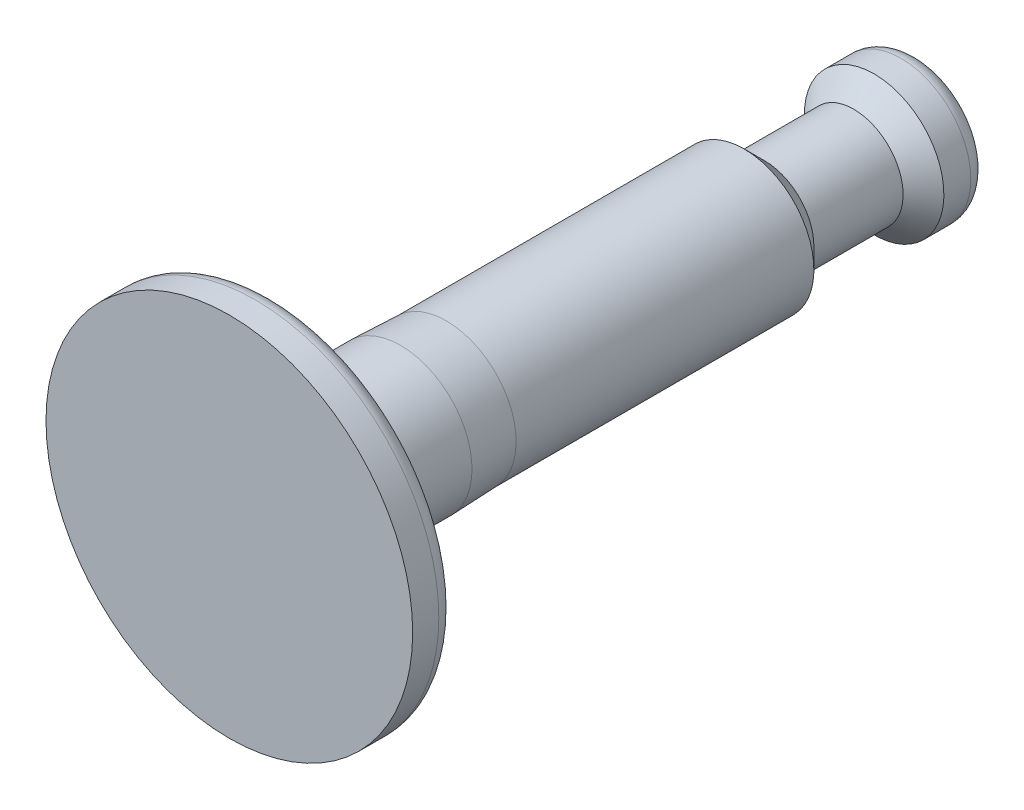
ISO-10303-21;
HEADER;
FILE_DESCRIPTION(('STEP AP214'),'2;1');
FILE_NAME('part.step','',(''),(''),'','','');
FILE_SCHEMA(('AUTOMOTIVE_DESIGN { 1 0 10303 214 1 1 1 1 }'));
ENDSEC;
DATA;
#1=APPLICATION_CONTEXT('core data for automotive mechanical design processes');
#2=APPLICATION_PROTOCOL_DEFINITION('international standard','automotive_design',2000,#1);
#3=PRODUCT_CONTEXT('',#1,'mechanical');
#4=PRODUCT('Part','Part','',(#3));
#5=PRODUCT_RELATED_PRODUCT_CATEGORY('part','',(#4));
#6=PRODUCT_DEFINITION_FORMATION('','',#4);
#7=PRODUCT_DEFINITION_CONTEXT('part definition',#1,'design');
#8=PRODUCT_DEFINITION('design','',#6,#7);
#9=PRODUCT_DEFINITION_SHAPE('','',#8);
#10=(LENGTH_UNIT() NAMED_UNIT(*) SI_UNIT(.MILLI.,.METRE.));
#11=(NAMED_UNIT(*) PLANE_ANGLE_UNIT() SI_UNIT($,.RADIAN.));
#12=(NAMED_UNIT(*) SI_UNIT($,.STERADIAN.) SOLID_ANGLE_UNIT());
#13=UNCERTAINTY_MEASURE_WITH_UNIT(LENGTH_MEASURE(1.E-05),#10,'distance_accuracy_value','');
#14=(GEOMETRIC_REPRESENTATION_CONTEXT(3) GLOBAL_UNCERTAINTY_ASSIGNED_CONTEXT((#13)) GLOBAL_UNIT_ASSIGNED_CONTEXT((#10,
#11,#12)) REPRESENTATION_CONTEXT('',''));
#15=CARTESIAN_POINT('',(0.,0.,0.));
#16=DIRECTION('',(0.,0.,1.));
#17=DIRECTION('',(1.,0.,0.));
#18=AXIS2_PLACEMENT_3D('',#15,#16,#17);
#19=CARTESIAN_POINT('',(0.,0.453951401167243,-34.));
#20=DIRECTION('',(0.,0.,-1.));
#21=DIRECTION('',(0.,1.,0.));
#22=AXIS2_PLACEMENT_3D('',#19,#20,#21);
#23=PLANE('',#22);
#24=CARTESIAN_POINT('',(0.,0.453951401167243,-34.));
#25=DIRECTION('',(0.,0.,-1.));
#26=DIRECTION('',(0.,1.,0.));
#27=AXIS2_PLACEMENT_3D('',#24,#25,#26);
#28=CIRCLE('',#27,2.99999999999998);
#29=CARTESIAN_POINT('',(0.,3.45395140116722,-34.));
#30=VERTEX_POINT('',#29);
#31=EDGE_CURVE('E10',#30,#30,#28,.T.);
#32=ORIENTED_EDGE('',*,*,#31,.T.);
#33=EDGE_LOOP('',(#32));
#34=FACE_BOUND('',#33,.T.);
#35=ADVANCED_FACE('F31',(#34),#23,.T.);
#36=CARTESIAN_POINT('',(0.,0.453951401167243,-33.));
#37=DIRECTION('',(0.,0.,-1.));
#38=DIRECTION('',(0.,1.,0.));
#39=AXIS2_PLACEMENT_3D('',#36,#37,#38);
#40=TOROIDAL_SURFACE('',#39,2.99999999999998,1.);
#41=CARTESIAN_POINT('',(0.,0.453951401167243,-33.));
#42=DIRECTION('',(0.,0.,-1.));
#43=DIRECTION('',(0.,1.,0.));
#44=AXIS2_PLACEMENT_3D('',#41,#42,#43);
#45=CIRCLE('',#44,3.99999999999998);
#46=CARTESIAN_POINT('',(0.,4.45395140116723,-33.));
#47=VERTEX_POINT('',#46);
#48=EDGE_CURVE('E37',#47,#47,#45,.T.);
#49=ORIENTED_EDGE('',*,*,#48,.T.);
#50=EDGE_LOOP('',(#49));
#51=FACE_BOUND('',#50,.T.);
#52=ORIENTED_EDGE('',*,*,#31,.F.);
#53=EDGE_LOOP('',(#52));
#54=FACE_BOUND('',#53,.T.);
#55=ADVANCED_FACE('F90',(#51,#54),#40,.T.);
#56=CARTESIAN_POINT('',(0.,0.453951401167243,-34.));
#57=DIRECTION('',(0.,0.,-1.));
#58=DIRECTION('',(0.,1.,0.));
#59=AXIS2_PLACEMENT_3D('',#56,#57,#58);
#60=CYLINDRICAL_SURFACE('',#59,3.99999999999999);
#61=CARTESIAN_POINT('',(0.,0.453951401167243,-31.456066505317));
#62=DIRECTION('',(0.,0.,-1.));
#63=DIRECTION('',(0.,1.,0.));
#64=AXIS2_PLACEMENT_3D('',#61,#62,#63);
#65=CIRCLE('',#64,4.);
#66=CARTESIAN_POINT('',(0.,4.45395140116724,-31.456066505317));
#67=VERTEX_POINT('',#66);
#68=EDGE_CURVE('E41',#67,#67,#65,.T.);
#69=ORIENTED_EDGE('',*,*,#68,.T.);
#70=EDGE_LOOP('',(#69));
#71=FACE_BOUND('',#70,.T.);
#72=ORIENTED_EDGE('',*,*,#48,.F.);
#73=EDGE_LOOP('',(#72));
#74=FACE_BOUND('',#73,.T.);
#75=ADVANCED_FACE('F94',(#71,#74),#60,.T.);
#76=CARTESIAN_POINT('',(0.,0.453951401167243,-31.456066505317));
#77=DIRECTION('',(0.,0.,-1.));
#78=DIRECTION('',(0.,1.,0.));
#79=AXIS2_PLACEMENT_3D('',#76,#77,#78);
#80=CONICAL_SURFACE('',#79,4.,0.785398163397465);
#81=CARTESIAN_POINT('',(0.,0.453951401167243,-30.2863122740949));
#82=DIRECTION('',(0.,0.,-1.));
#83=DIRECTION('',(0.,1.,0.));
#84=AXIS2_PLACEMENT_3D('',#81,#82,#83);
#85=CIRCLE('',#84,2.83024576877784);
#86=CARTESIAN_POINT('',(0.,3.28419716994508,-30.2863122740949));
#87=VERTEX_POINT('',#86);
#88=EDGE_CURVE('E45',#87,#87,#85,.T.);
#89=ORIENTED_EDGE('',*,*,#88,.T.);
#90=EDGE_LOOP('',(#89));
#91=FACE_BOUND('',#90,.T.);
#92=ORIENTED_EDGE('',*,*,#68,.F.);
#93=EDGE_LOOP('',(#92));
#94=FACE_BOUND('',#93,.T.);
#95=ADVANCED_FACE('F98',(#91,#94),#80,.T.);
#96=CARTESIAN_POINT('',(0.,0.453951401167243,-34.));
#97=DIRECTION('',(0.,0.,-1.));
#98=DIRECTION('',(0.,1.,0.));
#99=AXIS2_PLACEMENT_3D('',#96,#97,#98);
#100=CYLINDRICAL_SURFACE('',#99,2.83024576877785);
#101=CARTESIAN_POINT('',(0.,0.453951401167242,-25.1697542312221));
#102=DIRECTION('',(0.,0.,-1.));
#103=DIRECTION('',(0.,1.,0.));
#104=AXIS2_PLACEMENT_3D('',#101,#102,#103);
#105=CIRCLE('',#104,2.83024576877786);
#106=CARTESIAN_POINT('',(0.,3.2841971699451,-25.1697542312221));
#107=VERTEX_POINT('',#106);
#108=EDGE_CURVE('E50',#107,#107,#105,.T.);
#109=ORIENTED_EDGE('',*,*,#108,.T.);
#110=EDGE_LOOP('',(#109));
#111=FACE_BOUND('',#110,.T.);
#112=ORIENTED_EDGE('',*,*,#88,.F.);
#113=EDGE_LOOP('',(#112));
#114=FACE_BOUND('',#113,.T.);
#115=ADVANCED_FACE('F105',(#111,#114),#100,.T.);
#116=CARTESIAN_POINT('',(0.,0.453951401167242,-25.1697542312221));
#117=DIRECTION('',(0.,0.,1.));
#118=DIRECTION('',(0.,-1.,0.));
#119=AXIS2_PLACEMENT_3D('',#116,#117,#118);
#120=CONICAL_SURFACE('',#119,2.83024576877786,0.785398163397442);
#121=CARTESIAN_POINT('',(0.,0.453951401167242,-24.));
#122=DIRECTION('',(0.,0.,-1.));
#123=DIRECTION('',(0.,1.,0.));
#124=AXIS2_PLACEMENT_3D('',#121,#122,#123);
#125=CIRCLE('',#124,3.99999999999998);
#126=CARTESIAN_POINT('',(0.,4.45395140116722,-24.));
#127=VERTEX_POINT('',#126);
#128=EDGE_CURVE('E53',#127,#127,#125,.T.);
#129=ORIENTED_EDGE('',*,*,#128,.T.);
#130=EDGE_LOOP('',(#129));
#131=FACE_BOUND('',#130,.T.);
#132=ORIENTED_EDGE('',*,*,#108,.F.);
#133=EDGE_LOOP('',(#132));
#134=FACE_BOUND('',#133,.T.);
#135=ADVANCED_FACE('F109',(#131,#134),#120,.T.);
#136=CARTESIAN_POINT('',(0.,0.453951401167243,-34.));
#137=DIRECTION('',(0.,0.,-1.));
#138=DIRECTION('',(0.,1.,0.));
#139=AXIS2_PLACEMENT_3D('',#136,#137,#138);
#140=CYLINDRICAL_SURFACE('',#139,3.99999999999998);
#141=CARTESIAN_POINT('',(0.,0.45395140116724,-6.92222780636194));
#142=DIRECTION('',(0.,0.,-1.));
#143=DIRECTION('',(0.,1.,0.));
#144=AXIS2_PLACEMENT_3D('',#141,#142,#143);
#145=CIRCLE('',#144,3.99999999999998);
#146=CARTESIAN_POINT('',(0.,4.45395140116722,-6.92222780636194));
#147=VERTEX_POINT('',#146);
#148=EDGE_CURVE('E56',#147,#147,#145,.T.);
#149=ORIENTED_EDGE('',*,*,#148,.T.);
#150=EDGE_LOOP('',(#149));
#151=FACE_BOUND('',#150,.T.);
#152=ORIENTED_EDGE('',*,*,#128,.F.);
#153=EDGE_LOOP('',(#152));
#154=FACE_BOUND('',#153,.T.);
#155=ADVANCED_FACE('F113',(#151,#154),#140,.T.);
#156=CARTESIAN_POINT('',(0.,0.45395140116724,-6.92222780636194));
#157=DIRECTION('',(0.,0.,1.));
#158=DIRECTION('',(0.,-1.,0.));
#159=AXIS2_PLACEMENT_3D('',#156,#157,#158);
#160=CONICAL_SURFACE('',#159,3.99999999999998,0.0379745766067807);
#161=CARTESIAN_POINT('',(0.,0.45395140116724,-4.29015299841425));
#162=DIRECTION('',(0.,0.,-1.));
#163=DIRECTION('',(0.,1.,0.));
#164=AXIS2_PLACEMENT_3D('',#161,#162,#163);
#165=CIRCLE('',#164,4.1);
#166=CARTESIAN_POINT('',(0.,4.55395140116724,-4.29015299841424));
#167=VERTEX_POINT('',#166);
#168=EDGE_CURVE('E59',#167,#167,#165,.T.);
#169=ORIENTED_EDGE('',*,*,#168,.T.);
#170=EDGE_LOOP('',(#169));
#171=FACE_BOUND('',#170,.T.);
#172=ORIENTED_EDGE('',*,*,#148,.F.);
#173=EDGE_LOOP('',(#172));
#174=FACE_BOUND('',#173,.T.);
#175=ADVANCED_FACE('F117',(#171,#174),#160,.T.);
#176=CARTESIAN_POINT('',(0.,0.453951401167243,-34.));
#177=DIRECTION('',(0.,0.,-1.));
#178=DIRECTION('',(0.,1.,0.));
#179=AXIS2_PLACEMENT_3D('',#176,#177,#178);
#180=CYLINDRICAL_SURFACE('',#179,4.1);
#181=CARTESIAN_POINT('',(0.,0.453951401167239,2.02629940923806));
#182=DIRECTION('',(0.,0.,-1.));
#183=DIRECTION('',(0.,1.,0.));
#184=AXIS2_PLACEMENT_3D('',#181,#182,#183);
#185=CIRCLE('',#184,4.1);
#186=CARTESIAN_POINT('',(0.,4.55395140116724,2.02629940923806));
#187=VERTEX_POINT('',#186);
#188=EDGE_CURVE('E62',#187,#187,#185,.T.);
#189=ORIENTED_EDGE('',*,*,#188,.T.);
#190=EDGE_LOOP('',(#189));
#191=FACE_BOUND('',#190,.T.);
#192=ORIENTED_EDGE('',*,*,#168,.F.);
#193=EDGE_LOOP('',(#192));
#194=FACE_BOUND('',#193,.T.);
#195=ADVANCED_FACE('F121',(#191,#194),#180,.T.);
#196=CARTESIAN_POINT('',(0.,0.453951401167239,2.02629940923807));
#197=DIRECTION('',(0.,0.,-1.));
#198=DIRECTION('',(0.,1.,0.));
#199=AXIS2_PLACEMENT_3D('',#196,#197,#198);
#200=TOROIDAL_SURFACE('',#199,5.1,1.);
#201=CARTESIAN_POINT('',(0.,0.453951401167239,3.02629940923806));
#202=DIRECTION('',(0.,0.,-1.));
#203=DIRECTION('',(0.,1.,0.));
#204=AXIS2_PLACEMENT_3D('',#201,#202,#203);
#205=CIRCLE('',#204,5.1);
#206=CARTESIAN_POINT('',(0.,5.55395140116724,3.02629940923806));
#207=VERTEX_POINT('',#206);
#208=EDGE_CURVE('E65',#207,#207,#205,.T.);
#209=ORIENTED_EDGE('',*,*,#208,.T.);
#210=EDGE_LOOP('',(#209));
#211=FACE_BOUND('',#210,.T.);
#212=ORIENTED_EDGE('',*,*,#188,.F.);
#213=EDGE_LOOP('',(#212));
#214=FACE_BOUND('',#213,.T.);
#215=ADVANCED_FACE('F125',(#211,#214),#200,.F.);
#216=CARTESIAN_POINT('',(0.,5.55395140116724,3.02629940923807));
#217=DIRECTION('',(0.,0.,-1.));
#218=DIRECTION('',(0.,1.,0.));
#219=AXIS2_PLACEMENT_3D('',#216,#217,#218);
#220=PLANE('',#219);
#221=CARTESIAN_POINT('',(0.,0.453951401167239,3.02629940923806));
#222=DIRECTION('',(0.,0.,-1.));
#223=DIRECTION('',(0.,1.,0.));
#224=AXIS2_PLACEMENT_3D('',#221,#222,#223);
#225=CIRCLE('',#224,9.51485435059138);
#226=CARTESIAN_POINT('',(0.,9.96880575175862,3.02629940923806));
#227=VERTEX_POINT('',#226);
#228=EDGE_CURVE('E68',#227,#227,#225,.T.);
#229=ORIENTED_EDGE('',*,*,#228,.T.);
#230=EDGE_LOOP('',(#229));
#231=FACE_BOUND('',#230,.T.);
#232=ORIENTED_EDGE('',*,*,#208,.F.);
#233=EDGE_LOOP('',(#232));
#234=FACE_BOUND('',#233,.T.);
#235=ADVANCED_FACE('F129',(#231,#234),#220,.T.);
#236=CARTESIAN_POINT('',(0.,0.453951401167238,4.02629940923807));
#237=DIRECTION('',(0.,0.,-1.));
#238=DIRECTION('',(0.,1.,0.));
#239=AXIS2_PLACEMENT_3D('',#236,#237,#238);
#240=TOROIDAL_SURFACE('',#239,9.51485435059138,1.);
#241=CARTESIAN_POINT('',(0.,0.453951401167239,4.02629940923806));
#242=DIRECTION('',(0.,0.,-1.));
#243=DIRECTION('',(0.,1.,0.));
#244=AXIS2_PLACEMENT_3D('',#241,#242,#243);
#245=CIRCLE('',#244,10.5148543505914);
#246=CARTESIAN_POINT('',(0.,10.9688057517586,4.02629940923806));
#247=VERTEX_POINT('',#246);
#248=EDGE_CURVE('E71',#247,#247,#245,.T.);
#249=ORIENTED_EDGE('',*,*,#248,.T.);
#250=EDGE_LOOP('',(#249));
#251=FACE_BOUND('',#250,.T.);
#252=ORIENTED_EDGE('',*,*,#228,.F.);
#253=EDGE_LOOP('',(#252));
#254=FACE_BOUND('',#253,.T.);
#255=ADVANCED_FACE('F87',(#251,#254),#240,.T.);
#256=CARTESIAN_POINT('',(0.,0.453951401167243,-34.));
#257=DIRECTION('',(0.,0.,-1.));
#258=DIRECTION('',(0.,1.,0.));
#259=AXIS2_PLACEMENT_3D('',#256,#257,#258);
#260=CYLINDRICAL_SURFACE('',#259,10.5148543505914);
#261=CARTESIAN_POINT('',(0.,0.453951401167239,5.52629940923807));
#262=DIRECTION('',(0.,0.,-1.));
#263=DIRECTION('',(0.,1.,0.));
#264=AXIS2_PLACEMENT_3D('',#261,#262,#263);
#265=CIRCLE('',#264,10.5148543505914);
#266=CARTESIAN_POINT('',(0.,10.9688057517586,5.52629940923807));
#267=VERTEX_POINT('',#266);
#268=EDGE_CURVE('E74',#267,#267,#265,.T.);
#269=ORIENTED_EDGE('',*,*,#268,.T.);
#270=EDGE_LOOP('',(#269));
#271=FACE_BOUND('',#270,.T.);
#272=ORIENTED_EDGE('',*,*,#248,.F.);
#273=EDGE_LOOP('',(#272));
#274=FACE_BOUND('',#273,.T.);
#275=ADVANCED_FACE('F78',(#271,#274),#260,.T.);
#276=CARTESIAN_POINT('',(0.,0.453951401167243,5.52629940923806));
#277=DIRECTION('',(0.,0.,1.));
#278=DIRECTION('',(0.,-1.,0.));
#279=AXIS2_PLACEMENT_3D('',#276,#277,#278);
#280=PLANE('',#279);
#281=ORIENTED_EDGE('',*,*,#268,.F.);
#282=EDGE_LOOP('',(#281));
#283=FACE_BOUND('',#282,.T.);
#284=ADVANCED_FACE('F81',(#283),#280,.T.);
#285=CLOSED_SHELL('',(#35,#55,#75,#95,#115,#135,#155,#175,#195,#215,#235,#255,#275,#284));
#286=MANIFOLD_SOLID_BREP('B2',#285);
#287=ADVANCED_BREP_SHAPE_REPRESENTATION('',(#18,#286),#14);
#288=SHAPE_DEFINITION_REPRESENTATION(#9,#287);
ENDSEC;
END-ISO-10303-21;
